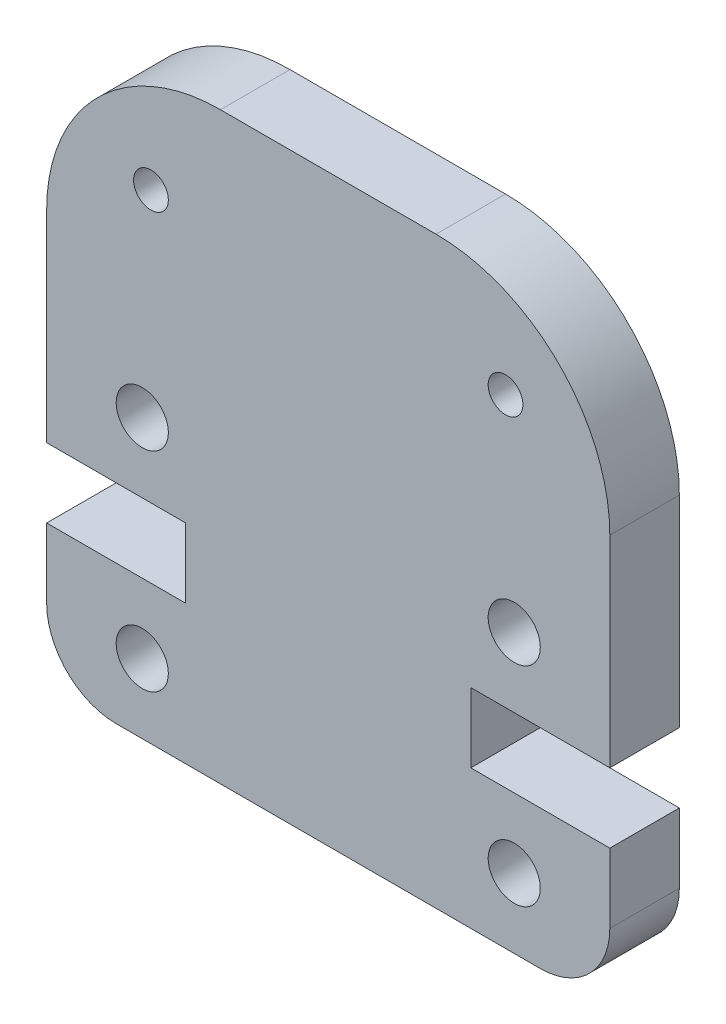
ISO-10303-21;
HEADER;
FILE_DESCRIPTION(('STEP AP214'),'2;1');
FILE_NAME('part.step','',(''),(''),'','','');
FILE_SCHEMA(('AUTOMOTIVE_DESIGN { 1 0 10303 214 1 1 1 1 }'));
ENDSEC;
DATA;
#1=APPLICATION_CONTEXT('core data for automotive mechanical design processes');
#2=APPLICATION_PROTOCOL_DEFINITION('international standard','automotive_design',2000,#1);
#3=PRODUCT_CONTEXT('',#1,'mechanical');
#4=PRODUCT('Part','Part','',(#3));
#5=PRODUCT_RELATED_PRODUCT_CATEGORY('part','',(#4));
#6=PRODUCT_DEFINITION_FORMATION('','',#4);
#7=PRODUCT_DEFINITION_CONTEXT('part definition',#1,'design');
#8=PRODUCT_DEFINITION('design','',#6,#7);
#9=PRODUCT_DEFINITION_SHAPE('','',#8);
#10=(LENGTH_UNIT() NAMED_UNIT(*) SI_UNIT(.MILLI.,.METRE.));
#11=(NAMED_UNIT(*) PLANE_ANGLE_UNIT() SI_UNIT($,.RADIAN.));
#12=(NAMED_UNIT(*) SI_UNIT($,.STERADIAN.) SOLID_ANGLE_UNIT());
#13=UNCERTAINTY_MEASURE_WITH_UNIT(LENGTH_MEASURE(1.E-05),#10,'distance_accuracy_value','');
#14=(GEOMETRIC_REPRESENTATION_CONTEXT(3) GLOBAL_UNCERTAINTY_ASSIGNED_CONTEXT((#13)) GLOBAL_UNIT_ASSIGNED_CONTEXT((#10,
#11,#12)) REPRESENTATION_CONTEXT('',''));
#15=CARTESIAN_POINT('',(0.,0.,0.));
#16=DIRECTION('',(0.,0.,1.));
#17=DIRECTION('',(1.,0.,0.));
#18=AXIS2_PLACEMENT_3D('',#15,#16,#17);
#19=CARTESIAN_POINT('',(5.,11.795,2.));
#20=DIRECTION('',(0.,0.,1.));
#21=DIRECTION('',(1.,0.,0.));
#22=AXIS2_PLACEMENT_3D('',#19,#20,#21);
#23=PLANE('',#22);
#24=CARTESIAN_POINT('',(2.75000000000089,2.,2.));
#25=DIRECTION('',(0.,0.,1.));
#26=DIRECTION('',(1.,0.,0.));
#27=AXIS2_PLACEMENT_3D('',#24,#25,#26);
#28=CIRCLE('',#27,0.750000000000087);
#29=CARTESIAN_POINT('',(3.50000000000098,2.,2.));
#30=VERTEX_POINT('',#29);
#31=EDGE_CURVE('E352',#30,#30,#28,.T.);
#32=ORIENTED_EDGE('',*,*,#31,.F.);
#33=EDGE_LOOP('',(#32));
#34=FACE_BOUND('',#33,.T.);
#35=CARTESIAN_POINT('',(3.00000000000434,13.7949999999999,2.));
#36=DIRECTION('',(0.,0.,1.));
#37=DIRECTION('',(1.,0.,0.));
#38=AXIS2_PLACEMENT_3D('',#35,#36,#37);
#39=CIRCLE('',#38,0.499999999999944);
#40=CARTESIAN_POINT('',(3.50000000000429,13.7949999999999,2.));
#41=VERTEX_POINT('',#40);
#42=EDGE_CURVE('E364',#41,#41,#39,.T.);
#43=ORIENTED_EDGE('',*,*,#42,.F.);
#44=EDGE_LOOP('',(#43));
#45=FACE_BOUND('',#44,.T.);
#46=CARTESIAN_POINT('',(13.4499999999991,2.,2.));
#47=DIRECTION('',(0.,0.,1.));
#48=DIRECTION('',(-1.,0.,0.));
#49=AXIS2_PLACEMENT_3D('',#46,#47,#48);
#50=CIRCLE('',#49,0.750000000000882);
#51=CARTESIAN_POINT('',(12.6999999999982,2.,2.));
#52=VERTEX_POINT('',#51);
#53=EDGE_CURVE('E182',#52,#52,#50,.T.);
#54=ORIENTED_EDGE('',*,*,#53,.F.);
#55=EDGE_LOOP('',(#54));
#56=FACE_BOUND('',#55,.T.);
#57=CARTESIAN_POINT('',(5.,11.795,2.));
#58=DIRECTION('',(0.,0.,1.));
#59=DIRECTION('',(1.,0.,0.));
#60=AXIS2_PLACEMENT_3D('',#57,#58,#59);
#61=CIRCLE('',#60,5.);
#62=CARTESIAN_POINT('',(5.,16.795,2.));
#63=VERTEX_POINT('',#62);
#64=CARTESIAN_POINT('',(0.,11.795,2.));
#65=VERTEX_POINT('',#64);
#66=EDGE_CURVE('E209',#63,#65,#61,.T.);
#67=ORIENTED_EDGE('',*,*,#66,.T.);
#68=DIRECTION('',(0.,-1.,0.));
#69=VECTOR('',#68,1.);
#70=CARTESIAN_POINT('',(0.,6.00000000000001,2.));
#71=LINE('',#70,#69);
#72=CARTESIAN_POINT('',(0.,6.00000000000001,2.));
#73=VERTEX_POINT('',#72);
#74=EDGE_CURVE('E117',#65,#73,#71,.T.);
#75=ORIENTED_EDGE('',*,*,#74,.T.);
#76=DIRECTION('',(1.,0.,0.));
#77=VECTOR('',#76,1.);
#78=CARTESIAN_POINT('',(0.,6.00000000000001,2.));
#79=LINE('',#78,#77);
#80=CARTESIAN_POINT('',(4.,6.00000000000001,2.));
#81=VERTEX_POINT('',#80);
#82=EDGE_CURVE('E248',#73,#81,#79,.T.);
#83=ORIENTED_EDGE('',*,*,#82,.T.);
#84=DIRECTION('',(0.,-1.,0.));
#85=VECTOR('',#84,1.);
#86=CARTESIAN_POINT('',(4.,6.00000000000001,2.));
#87=LINE('',#86,#85);
#88=CARTESIAN_POINT('',(4.,4.,2.));
#89=VERTEX_POINT('',#88);
#90=EDGE_CURVE('E267',#81,#89,#87,.T.);
#91=ORIENTED_EDGE('',*,*,#90,.T.);
#92=DIRECTION('',(-1.,0.,0.));
#93=VECTOR('',#92,1.);
#94=CARTESIAN_POINT('',(4.,4.,2.));
#95=LINE('',#94,#93);
#96=CARTESIAN_POINT('',(0.,4.,2.));
#97=VERTEX_POINT('',#96);
#98=EDGE_CURVE('E264',#89,#97,#95,.T.);
#99=ORIENTED_EDGE('',*,*,#98,.T.);
#100=DIRECTION('',(0.,-1.,0.));
#101=VECTOR('',#100,1.);
#102=CARTESIAN_POINT('',(0.,2.,2.));
#103=LINE('',#102,#101);
#104=CARTESIAN_POINT('',(0.,2.,2.));
#105=VERTEX_POINT('',#104);
#106=EDGE_CURVE('E266',#97,#105,#103,.T.);
#107=ORIENTED_EDGE('',*,*,#106,.T.);
#108=CARTESIAN_POINT('',(2.,2.,2.));
#109=DIRECTION('',(0.,0.,1.));
#110=DIRECTION('',(1.,0.,0.));
#111=AXIS2_PLACEMENT_3D('',#108,#109,#110);
#112=CIRCLE('',#111,2.);
#113=CARTESIAN_POINT('',(2.,0.,2.));
#114=VERTEX_POINT('',#113);
#115=EDGE_CURVE('E269',#105,#114,#112,.T.);
#116=ORIENTED_EDGE('',*,*,#115,.T.);
#117=DIRECTION('',(1.,0.,0.));
#118=VECTOR('',#117,1.);
#119=CARTESIAN_POINT('',(2.,0.,2.));
#120=LINE('',#119,#118);
#121=CARTESIAN_POINT('',(14.2,0.,2.));
#122=VERTEX_POINT('',#121);
#123=EDGE_CURVE('E275',#114,#122,#120,.T.);
#124=ORIENTED_EDGE('',*,*,#123,.T.);
#125=CARTESIAN_POINT('',(14.2,2.,2.));
#126=DIRECTION('',(0.,0.,1.));
#127=DIRECTION('',(-1.,0.,0.));
#128=AXIS2_PLACEMENT_3D('',#125,#126,#127);
#129=CIRCLE('',#128,2.);
#130=CARTESIAN_POINT('',(16.2,2.,2.));
#131=VERTEX_POINT('',#130);
#132=EDGE_CURVE('E277',#122,#131,#129,.T.);
#133=ORIENTED_EDGE('',*,*,#132,.T.);
#134=DIRECTION('',(0.,1.,0.));
#135=VECTOR('',#134,1.);
#136=CARTESIAN_POINT('',(16.2,2.,2.));
#137=LINE('',#136,#135);
#138=CARTESIAN_POINT('',(16.2,4.,2.));
#139=VERTEX_POINT('',#138);
#140=EDGE_CURVE('E279',#131,#139,#137,.T.);
#141=ORIENTED_EDGE('',*,*,#140,.T.);
#142=DIRECTION('',(-1.,0.,0.));
#143=VECTOR('',#142,1.);
#144=CARTESIAN_POINT('',(12.2,4.,2.));
#145=LINE('',#144,#143);
#146=CARTESIAN_POINT('',(12.2,4.,2.));
#147=VERTEX_POINT('',#146);
#148=EDGE_CURVE('E281',#139,#147,#145,.T.);
#149=ORIENTED_EDGE('',*,*,#148,.T.);
#150=DIRECTION('',(0.,1.,0.));
#151=VECTOR('',#150,1.);
#152=CARTESIAN_POINT('',(12.2,6.,2.));
#153=LINE('',#152,#151);
#154=CARTESIAN_POINT('',(12.2,6.,2.));
#155=VERTEX_POINT('',#154);
#156=EDGE_CURVE('E283',#147,#155,#153,.T.);
#157=ORIENTED_EDGE('',*,*,#156,.T.);
#158=DIRECTION('',(1.,0.,0.));
#159=VECTOR('',#158,1.);
#160=CARTESIAN_POINT('',(16.2,6.00000000000001,2.));
#161=LINE('',#160,#159);
#162=CARTESIAN_POINT('',(16.2,6.00000000000001,2.));
#163=VERTEX_POINT('',#162);
#164=EDGE_CURVE('E160',#155,#163,#161,.T.);
#165=ORIENTED_EDGE('',*,*,#164,.T.);
#166=DIRECTION('',(0.,1.,0.));
#167=VECTOR('',#166,1.);
#168=CARTESIAN_POINT('',(16.2,6.00000000000001,2.));
#169=LINE('',#168,#167);
#170=CARTESIAN_POINT('',(16.2,11.795,2.));
#171=VERTEX_POINT('',#170);
#172=EDGE_CURVE('E154',#163,#171,#169,.T.);
#173=ORIENTED_EDGE('',*,*,#172,.T.);
#174=CARTESIAN_POINT('',(11.2,11.795,2.));
#175=DIRECTION('',(0.,0.,1.));
#176=DIRECTION('',(-1.,0.,0.));
#177=AXIS2_PLACEMENT_3D('',#174,#175,#176);
#178=CIRCLE('',#177,5.);
#179=CARTESIAN_POINT('',(11.2,16.795,2.));
#180=VERTEX_POINT('',#179);
#181=EDGE_CURVE('E158',#171,#180,#178,.T.);
#182=ORIENTED_EDGE('',*,*,#181,.T.);
#183=DIRECTION('',(-1.,0.,0.));
#184=VECTOR('',#183,1.);
#185=CARTESIAN_POINT('',(5.,16.795,2.));
#186=LINE('',#185,#184);
#187=EDGE_CURVE('E50',#180,#63,#186,.T.);
#188=ORIENTED_EDGE('',*,*,#187,.T.);
#189=EDGE_LOOP('',(#67,#75,#83,#91,#99,#107,#116,#124,#133,#141,#149,#157,#165,#173,#182,#188));
#190=FACE_BOUND('',#189,.T.);
#191=CARTESIAN_POINT('',(13.4499999999991,7.99999999999954,2.));
#192=DIRECTION('',(0.,0.,1.));
#193=DIRECTION('',(1.,0.,0.));
#194=AXIS2_PLACEMENT_3D('',#191,#192,#193);
#195=CIRCLE('',#194,0.750000000000887);
#196=CARTESIAN_POINT('',(14.2,7.99999999999954,2.));
#197=VERTEX_POINT('',#196);
#198=EDGE_CURVE('E370',#197,#197,#195,.T.);
#199=ORIENTED_EDGE('',*,*,#198,.F.);
#200=EDGE_LOOP('',(#199));
#201=FACE_BOUND('',#200,.T.);
#202=CARTESIAN_POINT('',(13.1999999999957,13.7949999999999,2.));
#203=DIRECTION('',(0.,0.,1.));
#204=DIRECTION('',(-1.,0.,0.));
#205=AXIS2_PLACEMENT_3D('',#202,#203,#204);
#206=CIRCLE('',#205,0.499999999999945);
#207=CARTESIAN_POINT('',(12.6999999999957,13.7949999999999,2.));
#208=VERTEX_POINT('',#207);
#209=EDGE_CURVE('E358',#208,#208,#206,.T.);
#210=ORIENTED_EDGE('',*,*,#209,.F.);
#211=EDGE_LOOP('',(#210));
#212=FACE_BOUND('',#211,.T.);
#213=CARTESIAN_POINT('',(2.75000000000089,7.99999999999954,2.));
#214=DIRECTION('',(0.,0.,1.));
#215=DIRECTION('',(-1.,0.,0.));
#216=AXIS2_PLACEMENT_3D('',#213,#214,#215);
#217=CIRCLE('',#216,0.750000000000087);
#218=CARTESIAN_POINT('',(2.0000000000008,7.99999999999954,2.));
#219=VERTEX_POINT('',#218);
#220=EDGE_CURVE('E343',#219,#219,#217,.T.);
#221=ORIENTED_EDGE('',*,*,#220,.F.);
#222=EDGE_LOOP('',(#221));
#223=FACE_BOUND('',#222,.T.);
#224=ADVANCED_FACE('F33',(#34,#45,#56,#190,#201,#212,#223),#23,.T.);
#225=CARTESIAN_POINT('',(5.,11.795,0.));
#226=DIRECTION('',(0.,0.,1.));
#227=DIRECTION('',(1.,0.,0.));
#228=AXIS2_PLACEMENT_3D('',#225,#226,#227);
#229=PLANE('',#228);
#230=CARTESIAN_POINT('',(2.75000000000089,2.,0.));
#231=DIRECTION('',(0.,0.,1.));
#232=DIRECTION('',(1.,0.,0.));
#233=AXIS2_PLACEMENT_3D('',#230,#231,#232);
#234=CIRCLE('',#233,0.750000000000087);
#235=CARTESIAN_POINT('',(3.50000000000098,2.,0.));
#236=VERTEX_POINT('',#235);
#237=EDGE_CURVE('E349',#236,#236,#234,.T.);
#238=ORIENTED_EDGE('',*,*,#237,.T.);
#239=EDGE_LOOP('',(#238));
#240=FACE_BOUND('',#239,.T.);
#241=CARTESIAN_POINT('',(3.00000000000434,13.7949999999999,0.));
#242=DIRECTION('',(0.,0.,1.));
#243=DIRECTION('',(1.,0.,0.));
#244=AXIS2_PLACEMENT_3D('',#241,#242,#243);
#245=CIRCLE('',#244,0.499999999999944);
#246=CARTESIAN_POINT('',(3.50000000000429,13.7949999999999,0.));
#247=VERTEX_POINT('',#246);
#248=EDGE_CURVE('E361',#247,#247,#245,.T.);
#249=ORIENTED_EDGE('',*,*,#248,.T.);
#250=EDGE_LOOP('',(#249));
#251=FACE_BOUND('',#250,.T.);
#252=CARTESIAN_POINT('',(13.4499999999991,2.,0.));
#253=DIRECTION('',(0.,0.,1.));
#254=DIRECTION('',(-1.,0.,0.));
#255=AXIS2_PLACEMENT_3D('',#252,#253,#254);
#256=CIRCLE('',#255,0.750000000000882);
#257=CARTESIAN_POINT('',(12.6999999999982,2.,0.));
#258=VERTEX_POINT('',#257);
#259=EDGE_CURVE('E373',#258,#258,#256,.T.);
#260=ORIENTED_EDGE('',*,*,#259,.T.);
#261=EDGE_LOOP('',(#260));
#262=FACE_BOUND('',#261,.T.);
#263=CARTESIAN_POINT('',(5.,11.795,0.));
#264=DIRECTION('',(0.,0.,1.));
#265=DIRECTION('',(1.,0.,0.));
#266=AXIS2_PLACEMENT_3D('',#263,#264,#265);
#267=CIRCLE('',#266,5.);
#268=CARTESIAN_POINT('',(5.,16.795,0.));
#269=VERTEX_POINT('',#268);
#270=CARTESIAN_POINT('',(0.,11.795,0.));
#271=VERTEX_POINT('',#270);
#272=EDGE_CURVE('E178',#269,#271,#267,.T.);
#273=ORIENTED_EDGE('',*,*,#272,.F.);
#274=DIRECTION('',(-1.,0.,0.));
#275=VECTOR('',#274,1.);
#276=CARTESIAN_POINT('',(5.,16.795,0.));
#277=LINE('',#276,#275);
#278=CARTESIAN_POINT('',(11.2,16.795,0.));
#279=VERTEX_POINT('',#278);
#280=EDGE_CURVE('E109',#279,#269,#277,.T.);
#281=ORIENTED_EDGE('',*,*,#280,.F.);
#282=CARTESIAN_POINT('',(11.2,11.795,0.));
#283=DIRECTION('',(0.,0.,1.));
#284=DIRECTION('',(-1.,0.,0.));
#285=AXIS2_PLACEMENT_3D('',#282,#283,#284);
#286=CIRCLE('',#285,5.);
#287=CARTESIAN_POINT('',(16.2,11.795,0.));
#288=VERTEX_POINT('',#287);
#289=EDGE_CURVE('E103',#288,#279,#286,.T.);
#290=ORIENTED_EDGE('',*,*,#289,.F.);
#291=DIRECTION('',(0.,1.,0.));
#292=VECTOR('',#291,1.);
#293=CARTESIAN_POINT('',(16.2,6.00000000000001,0.));
#294=LINE('',#293,#292);
#295=CARTESIAN_POINT('',(16.2,6.00000000000001,0.));
#296=VERTEX_POINT('',#295);
#297=EDGE_CURVE('E168',#296,#288,#294,.T.);
#298=ORIENTED_EDGE('',*,*,#297,.F.);
#299=DIRECTION('',(1.,0.,0.));
#300=VECTOR('',#299,1.);
#301=CARTESIAN_POINT('',(16.2,6.00000000000001,0.));
#302=LINE('',#301,#300);
#303=CARTESIAN_POINT('',(12.2,6.,0.));
#304=VERTEX_POINT('',#303);
#305=EDGE_CURVE('E204',#304,#296,#302,.T.);
#306=ORIENTED_EDGE('',*,*,#305,.F.);
#307=DIRECTION('',(0.,1.,0.));
#308=VECTOR('',#307,1.);
#309=CARTESIAN_POINT('',(12.2,6.,0.));
#310=LINE('',#309,#308);
#311=CARTESIAN_POINT('',(12.2,4.,0.));
#312=VERTEX_POINT('',#311);
#313=EDGE_CURVE('E202',#312,#304,#310,.T.);
#314=ORIENTED_EDGE('',*,*,#313,.F.);
#315=DIRECTION('',(-1.,0.,0.));
#316=VECTOR('',#315,1.);
#317=CARTESIAN_POINT('',(12.2,4.,0.));
#318=LINE('',#317,#316);
#319=CARTESIAN_POINT('',(16.2,4.,0.));
#320=VERTEX_POINT('',#319);
#321=EDGE_CURVE('E200',#320,#312,#318,.T.);
#322=ORIENTED_EDGE('',*,*,#321,.F.);
#323=DIRECTION('',(0.,1.,0.));
#324=VECTOR('',#323,1.);
#325=CARTESIAN_POINT('',(16.2,2.,0.));
#326=LINE('',#325,#324);
#327=CARTESIAN_POINT('',(16.2,2.,0.));
#328=VERTEX_POINT('',#327);
#329=EDGE_CURVE('E198',#328,#320,#326,.T.);
#330=ORIENTED_EDGE('',*,*,#329,.F.);
#331=CARTESIAN_POINT('',(14.2,2.,0.));
#332=DIRECTION('',(0.,0.,1.));
#333=DIRECTION('',(-1.,0.,0.));
#334=AXIS2_PLACEMENT_3D('',#331,#332,#333);
#335=CIRCLE('',#334,2.);
#336=CARTESIAN_POINT('',(14.2,0.,0.));
#337=VERTEX_POINT('',#336);
#338=EDGE_CURVE('E196',#337,#328,#335,.T.);
#339=ORIENTED_EDGE('',*,*,#338,.F.);
#340=DIRECTION('',(1.,0.,0.));
#341=VECTOR('',#340,1.);
#342=CARTESIAN_POINT('',(2.,0.,0.));
#343=LINE('',#342,#341);
#344=CARTESIAN_POINT('',(2.,0.,0.));
#345=VERTEX_POINT('',#344);
#346=EDGE_CURVE('E194',#345,#337,#343,.T.);
#347=ORIENTED_EDGE('',*,*,#346,.F.);
#348=CARTESIAN_POINT('',(2.,2.,0.));
#349=DIRECTION('',(0.,0.,1.));
#350=DIRECTION('',(1.,0.,0.));
#351=AXIS2_PLACEMENT_3D('',#348,#349,#350);
#352=CIRCLE('',#351,2.);
#353=CARTESIAN_POINT('',(0.,2.,0.));
#354=VERTEX_POINT('',#353);
#355=EDGE_CURVE('E192',#354,#345,#352,.T.);
#356=ORIENTED_EDGE('',*,*,#355,.F.);
#357=DIRECTION('',(0.,-1.,0.));
#358=VECTOR('',#357,1.);
#359=CARTESIAN_POINT('',(0.,2.,0.));
#360=LINE('',#359,#358);
#361=CARTESIAN_POINT('',(0.,4.,0.));
#362=VERTEX_POINT('',#361);
#363=EDGE_CURVE('E190',#362,#354,#360,.T.);
#364=ORIENTED_EDGE('',*,*,#363,.F.);
#365=DIRECTION('',(-1.,0.,0.));
#366=VECTOR('',#365,1.);
#367=CARTESIAN_POINT('',(4.,4.,0.));
#368=LINE('',#367,#366);
#369=CARTESIAN_POINT('',(4.,4.,0.));
#370=VERTEX_POINT('',#369);
#371=EDGE_CURVE('E188',#370,#362,#368,.T.);
#372=ORIENTED_EDGE('',*,*,#371,.F.);
#373=DIRECTION('',(0.,-1.,0.));
#374=VECTOR('',#373,1.);
#375=CARTESIAN_POINT('',(4.,6.00000000000001,0.));
#376=LINE('',#375,#374);
#377=CARTESIAN_POINT('',(4.,6.00000000000001,0.));
#378=VERTEX_POINT('',#377);
#379=EDGE_CURVE('E186',#378,#370,#376,.T.);
#380=ORIENTED_EDGE('',*,*,#379,.F.);
#381=DIRECTION('',(1.,0.,0.));
#382=VECTOR('',#381,1.);
#383=CARTESIAN_POINT('',(0.,6.00000000000001,0.));
#384=LINE('',#383,#382);
#385=CARTESIAN_POINT('',(0.,6.00000000000001,0.));
#386=VERTEX_POINT('',#385);
#387=EDGE_CURVE('E184',#386,#378,#384,.T.);
#388=ORIENTED_EDGE('',*,*,#387,.F.);
#389=DIRECTION('',(0.,-1.,0.));
#390=VECTOR('',#389,1.);
#391=CARTESIAN_POINT('',(0.,6.00000000000001,0.));
#392=LINE('',#391,#390);
#393=EDGE_CURVE('E181',#271,#386,#392,.T.);
#394=ORIENTED_EDGE('',*,*,#393,.F.);
#395=EDGE_LOOP('',(#273,#281,#290,#298,#306,#314,#322,#330,#339,#347,#356,#364,#372,#380,#388,#394));
#396=FACE_BOUND('',#395,.T.);
#397=CARTESIAN_POINT('',(13.4499999999991,7.99999999999954,0.));
#398=DIRECTION('',(0.,0.,1.));
#399=DIRECTION('',(1.,0.,0.));
#400=AXIS2_PLACEMENT_3D('',#397,#398,#399);
#401=CIRCLE('',#400,0.750000000000887);
#402=CARTESIAN_POINT('',(14.2,7.99999999999954,0.));
#403=VERTEX_POINT('',#402);
#404=EDGE_CURVE('E367',#403,#403,#401,.T.);
#405=ORIENTED_EDGE('',*,*,#404,.T.);
#406=EDGE_LOOP('',(#405));
#407=FACE_BOUND('',#406,.T.);
#408=CARTESIAN_POINT('',(13.1999999999957,13.7949999999999,0.));
#409=DIRECTION('',(0.,0.,1.));
#410=DIRECTION('',(-1.,0.,0.));
#411=AXIS2_PLACEMENT_3D('',#408,#409,#410);
#412=CIRCLE('',#411,0.499999999999945);
#413=CARTESIAN_POINT('',(12.6999999999957,13.7949999999999,0.));
#414=VERTEX_POINT('',#413);
#415=EDGE_CURVE('E355',#414,#414,#412,.T.);
#416=ORIENTED_EDGE('',*,*,#415,.T.);
#417=EDGE_LOOP('',(#416));
#418=FACE_BOUND('',#417,.T.);
#419=CARTESIAN_POINT('',(2.75000000000089,7.99999999999954,0.));
#420=DIRECTION('',(0.,0.,1.));
#421=DIRECTION('',(-1.,0.,0.));
#422=AXIS2_PLACEMENT_3D('',#419,#420,#421);
#423=CIRCLE('',#422,0.750000000000087);
#424=CARTESIAN_POINT('',(2.0000000000008,7.99999999999954,0.));
#425=VERTEX_POINT('',#424);
#426=EDGE_CURVE('E346',#425,#425,#423,.T.);
#427=ORIENTED_EDGE('',*,*,#426,.T.);
#428=EDGE_LOOP('',(#427));
#429=FACE_BOUND('',#428,.T.);
#430=ADVANCED_FACE('F252',(#240,#251,#262,#396,#407,#418,#429),#229,.F.);
#431=CARTESIAN_POINT('',(5.,11.795,2.));
#432=DIRECTION('',(0.,0.,-1.));
#433=DIRECTION('',(-1.,0.,0.));
#434=AXIS2_PLACEMENT_3D('',#431,#432,#433);
#435=CYLINDRICAL_SURFACE('',#434,5.);
#436=ORIENTED_EDGE('',*,*,#272,.T.);
#437=DIRECTION('',(0.,0.,-1.));
#438=VECTOR('',#437,1.);
#439=CARTESIAN_POINT('',(0.,11.795,2.));
#440=LINE('',#439,#438);
#441=EDGE_CURVE('E11',#65,#271,#440,.T.);
#442=ORIENTED_EDGE('',*,*,#441,.F.);
#443=ORIENTED_EDGE('',*,*,#66,.F.);
#444=DIRECTION('',(0.,0.,-1.));
#445=VECTOR('',#444,1.);
#446=CARTESIAN_POINT('',(5.,16.795,2.));
#447=LINE('',#446,#445);
#448=EDGE_CURVE('E174',#63,#269,#447,.T.);
#449=ORIENTED_EDGE('',*,*,#448,.T.);
#450=EDGE_LOOP('',(#436,#442,#443,#449));
#451=FACE_BOUND('',#450,.T.);
#452=ADVANCED_FACE('F35',(#451),#435,.T.);
#453=CARTESIAN_POINT('',(0.,6.00000000000001,2.));
#454=DIRECTION('',(1.,0.,0.));
#455=DIRECTION('',(0.,0.,-1.));
#456=AXIS2_PLACEMENT_3D('',#453,#454,#455);
#457=PLANE('',#456);
#458=ORIENTED_EDGE('',*,*,#393,.T.);
#459=DIRECTION('',(0.,0.,-1.));
#460=VECTOR('',#459,1.);
#461=CARTESIAN_POINT('',(0.,6.00000000000001,2.));
#462=LINE('',#461,#460);
#463=EDGE_CURVE('E42',#73,#386,#462,.T.);
#464=ORIENTED_EDGE('',*,*,#463,.F.);
#465=ORIENTED_EDGE('',*,*,#74,.F.);
#466=ORIENTED_EDGE('',*,*,#441,.T.);
#467=EDGE_LOOP('',(#458,#464,#465,#466));
#468=FACE_BOUND('',#467,.T.);
#469=ADVANCED_FACE('F540',(#468),#457,.F.);
#470=CARTESIAN_POINT('',(0.,6.00000000000001,2.));
#471=DIRECTION('',(0.,1.,0.));
#472=DIRECTION('',(0.,0.,1.));
#473=AXIS2_PLACEMENT_3D('',#470,#471,#472);
#474=PLANE('',#473);
#475=ORIENTED_EDGE('',*,*,#387,.T.);
#476=DIRECTION('',(0.,0.,-1.));
#477=VECTOR('',#476,1.);
#478=CARTESIAN_POINT('',(4.,6.00000000000001,2.));
#479=LINE('',#478,#477);
#480=EDGE_CURVE('E240',#81,#378,#479,.T.);
#481=ORIENTED_EDGE('',*,*,#480,.F.);
#482=ORIENTED_EDGE('',*,*,#82,.F.);
#483=ORIENTED_EDGE('',*,*,#463,.T.);
#484=EDGE_LOOP('',(#475,#481,#482,#483));
#485=FACE_BOUND('',#484,.T.);
#486=ADVANCED_FACE('F246',(#485),#474,.F.);
#487=CARTESIAN_POINT('',(4.,6.00000000000001,2.));
#488=DIRECTION('',(1.,0.,0.));
#489=DIRECTION('',(0.,0.,-1.));
#490=AXIS2_PLACEMENT_3D('',#487,#488,#489);
#491=PLANE('',#490);
#492=ORIENTED_EDGE('',*,*,#379,.T.);
#493=DIRECTION('',(0.,0.,-1.));
#494=VECTOR('',#493,1.);
#495=CARTESIAN_POINT('',(4.,4.,2.));
#496=LINE('',#495,#494);
#497=EDGE_CURVE('E237',#89,#370,#496,.T.);
#498=ORIENTED_EDGE('',*,*,#497,.F.);
#499=ORIENTED_EDGE('',*,*,#90,.F.);
#500=ORIENTED_EDGE('',*,*,#480,.T.);
#501=EDGE_LOOP('',(#492,#498,#499,#500));
#502=FACE_BOUND('',#501,.T.);
#503=ADVANCED_FACE('F258',(#502),#491,.F.);
#504=CARTESIAN_POINT('',(4.,4.,2.));
#505=DIRECTION('',(0.,-1.,0.));
#506=DIRECTION('',(0.,0.,-1.));
#507=AXIS2_PLACEMENT_3D('',#504,#505,#506);
#508=PLANE('',#507);
#509=ORIENTED_EDGE('',*,*,#371,.T.);
#510=DIRECTION('',(0.,0.,-1.));
#511=VECTOR('',#510,1.);
#512=CARTESIAN_POINT('',(0.,4.,2.));
#513=LINE('',#512,#511);
#514=EDGE_CURVE('E234',#97,#362,#513,.T.);
#515=ORIENTED_EDGE('',*,*,#514,.F.);
#516=ORIENTED_EDGE('',*,*,#98,.F.);
#517=ORIENTED_EDGE('',*,*,#497,.T.);
#518=EDGE_LOOP('',(#509,#515,#516,#517));
#519=FACE_BOUND('',#518,.T.);
#520=ADVANCED_FACE('F262',(#519),#508,.F.);
#521=CARTESIAN_POINT('',(0.,2.,2.));
#522=DIRECTION('',(1.,0.,0.));
#523=DIRECTION('',(0.,0.,-1.));
#524=AXIS2_PLACEMENT_3D('',#521,#522,#523);
#525=PLANE('',#524);
#526=ORIENTED_EDGE('',*,*,#363,.T.);
#527=DIRECTION('',(0.,0.,-1.));
#528=VECTOR('',#527,1.);
#529=CARTESIAN_POINT('',(0.,2.,2.));
#530=LINE('',#529,#528);
#531=EDGE_CURVE('E231',#105,#354,#530,.T.);
#532=ORIENTED_EDGE('',*,*,#531,.F.);
#533=ORIENTED_EDGE('',*,*,#106,.F.);
#534=ORIENTED_EDGE('',*,*,#514,.T.);
#535=EDGE_LOOP('',(#526,#532,#533,#534));
#536=FACE_BOUND('',#535,.T.);
#537=ADVANCED_FACE('F505',(#536),#525,.F.);
#538=CARTESIAN_POINT('',(2.,2.,2.));
#539=DIRECTION('',(0.,0.,-1.));
#540=DIRECTION('',(-1.,0.,0.));
#541=AXIS2_PLACEMENT_3D('',#538,#539,#540);
#542=CYLINDRICAL_SURFACE('',#541,2.);
#543=ORIENTED_EDGE('',*,*,#355,.T.);
#544=DIRECTION('',(0.,0.,-1.));
#545=VECTOR('',#544,1.);
#546=CARTESIAN_POINT('',(2.,0.,2.));
#547=LINE('',#546,#545);
#548=EDGE_CURVE('E228',#114,#345,#547,.T.);
#549=ORIENTED_EDGE('',*,*,#548,.F.);
#550=ORIENTED_EDGE('',*,*,#115,.F.);
#551=ORIENTED_EDGE('',*,*,#531,.T.);
#552=EDGE_LOOP('',(#543,#549,#550,#551));
#553=FACE_BOUND('',#552,.T.);
#554=ADVANCED_FACE('F495',(#553),#542,.T.);
#555=CARTESIAN_POINT('',(2.,0.,2.));
#556=DIRECTION('',(0.,1.,0.));
#557=DIRECTION('',(-1.,0.,0.));
#558=AXIS2_PLACEMENT_3D('',#555,#556,#557);
#559=PLANE('',#558);
#560=ORIENTED_EDGE('',*,*,#346,.T.);
#561=DIRECTION('',(0.,0.,-1.));
#562=VECTOR('',#561,1.);
#563=CARTESIAN_POINT('',(14.2,0.,2.));
#564=LINE('',#563,#562);
#565=EDGE_CURVE('E225',#122,#337,#564,.T.);
#566=ORIENTED_EDGE('',*,*,#565,.F.);
#567=ORIENTED_EDGE('',*,*,#123,.F.);
#568=ORIENTED_EDGE('',*,*,#548,.T.);
#569=EDGE_LOOP('',(#560,#566,#567,#568));
#570=FACE_BOUND('',#569,.T.);
#571=ADVANCED_FACE('F485',(#570),#559,.F.);
#572=CARTESIAN_POINT('',(14.2,2.,2.));
#573=DIRECTION('',(0.,0.,-1.));
#574=DIRECTION('',(-1.,0.,0.));
#575=AXIS2_PLACEMENT_3D('',#572,#573,#574);
#576=CYLINDRICAL_SURFACE('',#575,2.);
#577=ORIENTED_EDGE('',*,*,#338,.T.);
#578=DIRECTION('',(0.,0.,-1.));
#579=VECTOR('',#578,1.);
#580=CARTESIAN_POINT('',(16.2,2.,2.));
#581=LINE('',#580,#579);
#582=EDGE_CURVE('E222',#131,#328,#581,.T.);
#583=ORIENTED_EDGE('',*,*,#582,.F.);
#584=ORIENTED_EDGE('',*,*,#132,.F.);
#585=ORIENTED_EDGE('',*,*,#565,.T.);
#586=EDGE_LOOP('',(#577,#583,#584,#585));
#587=FACE_BOUND('',#586,.T.);
#588=ADVANCED_FACE('F475',(#587),#576,.T.);
#589=CARTESIAN_POINT('',(16.2,2.,2.));
#590=DIRECTION('',(-1.,0.,0.));
#591=DIRECTION('',(0.,0.,1.));
#592=AXIS2_PLACEMENT_3D('',#589,#590,#591);
#593=PLANE('',#592);
#594=ORIENTED_EDGE('',*,*,#329,.T.);
#595=DIRECTION('',(0.,0.,-1.));
#596=VECTOR('',#595,1.);
#597=CARTESIAN_POINT('',(16.2,4.,2.));
#598=LINE('',#597,#596);
#599=EDGE_CURVE('E219',#139,#320,#598,.T.);
#600=ORIENTED_EDGE('',*,*,#599,.F.);
#601=ORIENTED_EDGE('',*,*,#140,.F.);
#602=ORIENTED_EDGE('',*,*,#582,.T.);
#603=EDGE_LOOP('',(#594,#600,#601,#602));
#604=FACE_BOUND('',#603,.T.);
#605=ADVANCED_FACE('F465',(#604),#593,.F.);
#606=CARTESIAN_POINT('',(12.2,4.,2.));
#607=DIRECTION('',(0.,-1.,0.));
#608=DIRECTION('',(1.,0.,0.));
#609=AXIS2_PLACEMENT_3D('',#606,#607,#608);
#610=PLANE('',#609);
#611=ORIENTED_EDGE('',*,*,#321,.T.);
#612=DIRECTION('',(0.,0.,-1.));
#613=VECTOR('',#612,1.);
#614=CARTESIAN_POINT('',(12.2,4.,2.));
#615=LINE('',#614,#613);
#616=EDGE_CURVE('E216',#147,#312,#615,.T.);
#617=ORIENTED_EDGE('',*,*,#616,.F.);
#618=ORIENTED_EDGE('',*,*,#148,.F.);
#619=ORIENTED_EDGE('',*,*,#599,.T.);
#620=EDGE_LOOP('',(#611,#617,#618,#619));
#621=FACE_BOUND('',#620,.T.);
#622=ADVANCED_FACE('F456',(#621),#610,.F.);
#623=CARTESIAN_POINT('',(12.2,6.,2.));
#624=DIRECTION('',(-1.,0.,0.));
#625=DIRECTION('',(0.,0.,1.));
#626=AXIS2_PLACEMENT_3D('',#623,#624,#625);
#627=PLANE('',#626);
#628=ORIENTED_EDGE('',*,*,#313,.T.);
#629=DIRECTION('',(0.,0.,-1.));
#630=VECTOR('',#629,1.);
#631=CARTESIAN_POINT('',(12.2,6.,2.));
#632=LINE('',#631,#630);
#633=EDGE_CURVE('E213',#155,#304,#632,.T.);
#634=ORIENTED_EDGE('',*,*,#633,.F.);
#635=ORIENTED_EDGE('',*,*,#156,.F.);
#636=ORIENTED_EDGE('',*,*,#616,.T.);
#637=EDGE_LOOP('',(#628,#634,#635,#636));
#638=FACE_BOUND('',#637,.T.);
#639=ADVANCED_FACE('F289',(#638),#627,.F.);
#640=CARTESIAN_POINT('',(16.2,6.00000000000001,2.));
#641=DIRECTION('',(0.,1.,0.));
#642=DIRECTION('',(-1.,0.,0.));
#643=AXIS2_PLACEMENT_3D('',#640,#641,#642);
#644=PLANE('',#643);
#645=ORIENTED_EDGE('',*,*,#305,.T.);
#646=DIRECTION('',(0.,0.,-1.));
#647=VECTOR('',#646,1.);
#648=CARTESIAN_POINT('',(16.2,6.00000000000001,2.));
#649=LINE('',#648,#647);
#650=EDGE_CURVE('E169',#163,#296,#649,.T.);
#651=ORIENTED_EDGE('',*,*,#650,.F.);
#652=ORIENTED_EDGE('',*,*,#164,.F.);
#653=ORIENTED_EDGE('',*,*,#633,.T.);
#654=EDGE_LOOP('',(#645,#651,#652,#653));
#655=FACE_BOUND('',#654,.T.);
#656=ADVANCED_FACE('F293',(#655),#644,.F.);
#657=CARTESIAN_POINT('',(16.2,6.00000000000001,2.));
#658=DIRECTION('',(-1.,0.,0.));
#659=DIRECTION('',(0.,-1.,0.));
#660=AXIS2_PLACEMENT_3D('',#657,#658,#659);
#661=PLANE('',#660);
#662=ORIENTED_EDGE('',*,*,#297,.T.);
#663=DIRECTION('',(0.,0.,-1.));
#664=VECTOR('',#663,1.);
#665=CARTESIAN_POINT('',(16.2,11.795,2.));
#666=LINE('',#665,#664);
#667=EDGE_CURVE('E165',#171,#288,#666,.T.);
#668=ORIENTED_EDGE('',*,*,#667,.F.);
#669=ORIENTED_EDGE('',*,*,#172,.F.);
#670=ORIENTED_EDGE('',*,*,#650,.T.);
#671=EDGE_LOOP('',(#662,#668,#669,#670));
#672=FACE_BOUND('',#671,.T.);
#673=ADVANCED_FACE('F166',(#672),#661,.F.);
#674=CARTESIAN_POINT('',(11.2,11.795,2.));
#675=DIRECTION('',(0.,0.,-1.));
#676=DIRECTION('',(-1.,0.,0.));
#677=AXIS2_PLACEMENT_3D('',#674,#675,#676);
#678=CYLINDRICAL_SURFACE('',#677,5.);
#679=ORIENTED_EDGE('',*,*,#289,.T.);
#680=DIRECTION('',(0.,0.,-1.));
#681=VECTOR('',#680,1.);
#682=CARTESIAN_POINT('',(11.2,16.795,2.));
#683=LINE('',#682,#681);
#684=EDGE_CURVE('E170',#180,#279,#683,.T.);
#685=ORIENTED_EDGE('',*,*,#684,.F.);
#686=ORIENTED_EDGE('',*,*,#181,.F.);
#687=ORIENTED_EDGE('',*,*,#667,.T.);
#688=EDGE_LOOP('',(#679,#685,#686,#687));
#689=FACE_BOUND('',#688,.T.);
#690=ADVANCED_FACE('F172',(#689),#678,.T.);
#691=CARTESIAN_POINT('',(5.,16.795,2.));
#692=DIRECTION('',(0.,-1.,0.));
#693=DIRECTION('',(0.,0.,-1.));
#694=AXIS2_PLACEMENT_3D('',#691,#692,#693);
#695=PLANE('',#694);
#696=ORIENTED_EDGE('',*,*,#280,.T.);
#697=ORIENTED_EDGE('',*,*,#448,.F.);
#698=ORIENTED_EDGE('',*,*,#187,.F.);
#699=ORIENTED_EDGE('',*,*,#684,.T.);
#700=EDGE_LOOP('',(#696,#697,#698,#699));
#701=FACE_BOUND('',#700,.T.);
#702=ADVANCED_FACE('F297',(#701),#695,.F.);
#703=CARTESIAN_POINT('',(13.4499999999991,2.,2.));
#704=DIRECTION('',(0.,0.,-1.));
#705=DIRECTION('',(-1.,0.,0.));
#706=AXIS2_PLACEMENT_3D('',#703,#704,#705);
#707=CYLINDRICAL_SURFACE('',#706,0.750000000000882);
#708=ORIENTED_EDGE('',*,*,#53,.T.);
#709=EDGE_LOOP('',(#708));
#710=FACE_BOUND('',#709,.T.);
#711=ORIENTED_EDGE('',*,*,#259,.F.);
#712=EDGE_LOOP('',(#711));
#713=FACE_BOUND('',#712,.T.);
#714=ADVANCED_FACE('F299',(#710,#713),#707,.F.);
#715=CARTESIAN_POINT('',(13.4499999999991,7.99999999999954,2.));
#716=DIRECTION('',(0.,0.,-1.));
#717=DIRECTION('',(-1.,0.,0.));
#718=AXIS2_PLACEMENT_3D('',#715,#716,#717);
#719=CYLINDRICAL_SURFACE('',#718,0.750000000000887);
#720=ORIENTED_EDGE('',*,*,#198,.T.);
#721=EDGE_LOOP('',(#720));
#722=FACE_BOUND('',#721,.T.);
#723=ORIENTED_EDGE('',*,*,#404,.F.);
#724=EDGE_LOOP('',(#723));
#725=FACE_BOUND('',#724,.T.);
#726=ADVANCED_FACE('F305',(#722,#725),#719,.F.);
#727=CARTESIAN_POINT('',(3.00000000000434,13.7949999999999,2.));
#728=DIRECTION('',(0.,0.,-1.));
#729=DIRECTION('',(-1.,0.,0.));
#730=AXIS2_PLACEMENT_3D('',#727,#728,#729);
#731=CYLINDRICAL_SURFACE('',#730,0.499999999999944);
#732=ORIENTED_EDGE('',*,*,#42,.T.);
#733=EDGE_LOOP('',(#732));
#734=FACE_BOUND('',#733,.T.);
#735=ORIENTED_EDGE('',*,*,#248,.F.);
#736=EDGE_LOOP('',(#735));
#737=FACE_BOUND('',#736,.T.);
#738=ADVANCED_FACE('F322',(#734,#737),#731,.F.);
#739=CARTESIAN_POINT('',(13.1999999999957,13.7949999999999,2.));
#740=DIRECTION('',(0.,0.,-1.));
#741=DIRECTION('',(-1.,0.,0.));
#742=AXIS2_PLACEMENT_3D('',#739,#740,#741);
#743=CYLINDRICAL_SURFACE('',#742,0.499999999999945);
#744=ORIENTED_EDGE('',*,*,#209,.T.);
#745=EDGE_LOOP('',(#744));
#746=FACE_BOUND('',#745,.T.);
#747=ORIENTED_EDGE('',*,*,#415,.F.);
#748=EDGE_LOOP('',(#747));
#749=FACE_BOUND('',#748,.T.);
#750=ADVANCED_FACE('F326',(#746,#749),#743,.F.);
#751=CARTESIAN_POINT('',(2.75000000000089,2.,2.));
#752=DIRECTION('',(0.,0.,-1.));
#753=DIRECTION('',(-1.,0.,0.));
#754=AXIS2_PLACEMENT_3D('',#751,#752,#753);
#755=CYLINDRICAL_SURFACE('',#754,0.750000000000087);
#756=ORIENTED_EDGE('',*,*,#31,.T.);
#757=EDGE_LOOP('',(#756));
#758=FACE_BOUND('',#757,.T.);
#759=ORIENTED_EDGE('',*,*,#237,.F.);
#760=EDGE_LOOP('',(#759));
#761=FACE_BOUND('',#760,.T.);
#762=ADVANCED_FACE('F330',(#758,#761),#755,.F.);
#763=CARTESIAN_POINT('',(2.75000000000089,7.99999999999954,2.));
#764=DIRECTION('',(0.,0.,-1.));
#765=DIRECTION('',(-1.,0.,0.));
#766=AXIS2_PLACEMENT_3D('',#763,#764,#765);
#767=CYLINDRICAL_SURFACE('',#766,0.750000000000087);
#768=ORIENTED_EDGE('',*,*,#220,.T.);
#769=EDGE_LOOP('',(#768));
#770=FACE_BOUND('',#769,.T.);
#771=ORIENTED_EDGE('',*,*,#426,.F.);
#772=EDGE_LOOP('',(#771));
#773=FACE_BOUND('',#772,.T.);
#774=ADVANCED_FACE('F334',(#770,#773),#767,.F.);
#775=CLOSED_SHELL('',(#224,#430,#452,#469,#486,#503,#520,#537,#554,#571,#588,#605,#622,#639,
#656,#673,#690,#702,#714,#726,#738,#750,#762,#774));
#776=MANIFOLD_SOLID_BREP('B2',#775);
#777=ADVANCED_BREP_SHAPE_REPRESENTATION('',(#18,#776),#14);
#778=SHAPE_DEFINITION_REPRESENTATION(#9,#777);
ENDSEC;
END-ISO-10303-21;
